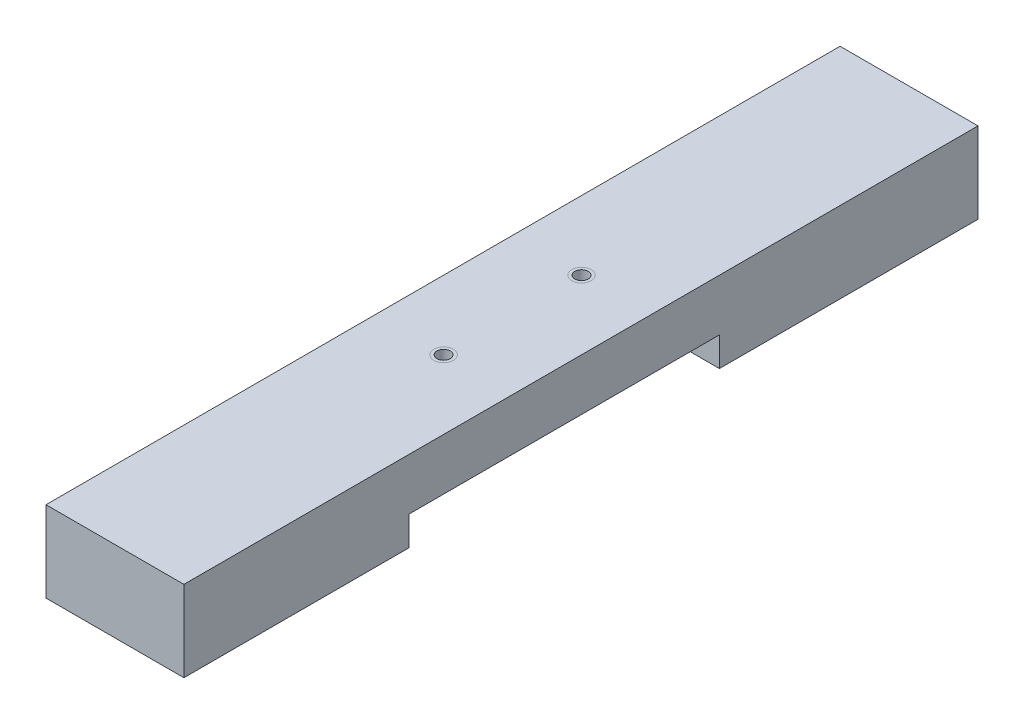
ISO-10303-21;
HEADER;
FILE_DESCRIPTION(('STEP AP214'),'2;1');
FILE_NAME('part.step','',(''),(''),'','','');
FILE_SCHEMA(('AUTOMOTIVE_DESIGN { 1 0 10303 214 1 1 1 1 }'));
ENDSEC;
DATA;
#1=APPLICATION_CONTEXT('core data for automotive mechanical design processes');
#2=APPLICATION_PROTOCOL_DEFINITION('international standard','automotive_design',2000,#1);
#3=PRODUCT_CONTEXT('',#1,'mechanical');
#4=PRODUCT('Part','Part','',(#3));
#5=PRODUCT_RELATED_PRODUCT_CATEGORY('part','',(#4));
#6=PRODUCT_DEFINITION_FORMATION('','',#4);
#7=PRODUCT_DEFINITION_CONTEXT('part definition',#1,'design');
#8=PRODUCT_DEFINITION('design','',#6,#7);
#9=PRODUCT_DEFINITION_SHAPE('','',#8);
#10=(LENGTH_UNIT() NAMED_UNIT(*) SI_UNIT(.MILLI.,.METRE.));
#11=(NAMED_UNIT(*) PLANE_ANGLE_UNIT() SI_UNIT($,.RADIAN.));
#12=(NAMED_UNIT(*) SI_UNIT($,.STERADIAN.) SOLID_ANGLE_UNIT());
#13=UNCERTAINTY_MEASURE_WITH_UNIT(LENGTH_MEASURE(1.E-05),#10,'distance_accuracy_value','');
#14=(GEOMETRIC_REPRESENTATION_CONTEXT(3) GLOBAL_UNCERTAINTY_ASSIGNED_CONTEXT((#13)) GLOBAL_UNIT_ASSIGNED_CONTEXT((#10,
#11,#12)) REPRESENTATION_CONTEXT('',''));
#15=CARTESIAN_POINT('',(0.,0.,0.));
#16=DIRECTION('',(0.,0.,1.));
#17=DIRECTION('',(1.,0.,0.));
#18=AXIS2_PLACEMENT_3D('',#15,#16,#17);
#19=CARTESIAN_POINT('',(0.,59.6,585.0001));
#20=DIRECTION('',(0.,-1.,0.));
#21=DIRECTION('',(0.,0.,-1.));
#22=AXIS2_PLACEMENT_3D('',#19,#20,#21);
#23=PLANE('',#22);
#24=CARTESIAN_POINT('',(50.8,59.6,241.3));
#25=DIRECTION('',(0.,-1.,0.));
#26=DIRECTION('',(0.,0.,-1.));
#27=AXIS2_PLACEMENT_3D('',#24,#25,#26);
#28=CIRCLE('',#27,7.14374999999999);
#29=CARTESIAN_POINT('',(50.8,59.6,234.15625));
#30=VERTEX_POINT('',#29);
#31=EDGE_CURVE('E56',#30,#30,#28,.F.);
#32=ORIENTED_EDGE('',*,*,#31,.F.);
#33=EDGE_LOOP('',(#32));
#34=FACE_BOUND('',#33,.T.);
#35=DIRECTION('',(-1.,0.,0.));
#36=VECTOR('',#35,1.);
#37=CARTESIAN_POINT('',(0.,59.6,0.));
#38=LINE('',#37,#36);
#39=CARTESIAN_POINT('',(101.6,59.6,0.));
#40=VERTEX_POINT('',#39);
#41=CARTESIAN_POINT('',(0.,59.6,0.));
#42=VERTEX_POINT('',#41);
#43=EDGE_CURVE('E93',#40,#42,#38,.T.);
#44=ORIENTED_EDGE('',*,*,#43,.T.);
#45=DIRECTION('',(0.,0.,-1.));
#46=VECTOR('',#45,1.);
#47=CARTESIAN_POINT('',(0.,59.6,585.0001));
#48=LINE('',#47,#46);
#49=CARTESIAN_POINT('',(0.,59.6,585.0001));
#50=VERTEX_POINT('',#49);
#51=EDGE_CURVE('E312',#50,#42,#48,.T.);
#52=ORIENTED_EDGE('',*,*,#51,.F.);
#53=DIRECTION('',(-1.,0.,0.));
#54=VECTOR('',#53,1.);
#55=CARTESIAN_POINT('',(0.,59.6,585.0001));
#56=LINE('',#55,#54);
#57=CARTESIAN_POINT('',(101.6,59.6,585.0001));
#58=VERTEX_POINT('',#57);
#59=EDGE_CURVE('E72',#58,#50,#56,.T.);
#60=ORIENTED_EDGE('',*,*,#59,.F.);
#61=DIRECTION('',(0.,0.,-1.));
#62=VECTOR('',#61,1.);
#63=CARTESIAN_POINT('',(101.6,59.6,585.0001));
#64=LINE('',#63,#62);
#65=EDGE_CURVE('E147',#58,#40,#64,.T.);
#66=ORIENTED_EDGE('',*,*,#65,.T.);
#67=EDGE_LOOP('',(#44,#52,#60,#66));
#68=FACE_BOUND('',#67,.T.);
#69=CARTESIAN_POINT('',(50.8,59.6,342.9));
#70=DIRECTION('',(0.,-1.,0.));
#71=DIRECTION('',(0.,0.,-1.));
#72=AXIS2_PLACEMENT_3D('',#69,#70,#71);
#73=CIRCLE('',#72,7.14375);
#74=CARTESIAN_POINT('',(50.8,59.6,335.75625));
#75=VERTEX_POINT('',#74);
#76=EDGE_CURVE('E12',#75,#75,#73,.F.);
#77=ORIENTED_EDGE('',*,*,#76,.F.);
#78=EDGE_LOOP('',(#77));
#79=FACE_BOUND('',#78,.T.);
#80=ADVANCED_FACE('F47',(#34,#68,#79),#23,.F.);
#81=ORIENTED_EDGE('',*,*,#76,.T.);
#82=EDGE_LOOP('',(#81));
#83=FACE_BOUND('',#82,.T.);
#84=CARTESIAN_POINT('',(50.8,59.6,342.9));
#85=DIRECTION('',(0.,-1.,0.));
#86=DIRECTION('',(0.,0.,-1.));
#87=AXIS2_PLACEMENT_3D('',#84,#85,#86);
#88=CIRCLE('',#87,4.93435191606347);
#89=CARTESIAN_POINT('',(50.8,59.6,337.965648083937));
#90=VERTEX_POINT('',#89);
#91=EDGE_CURVE('E161',#90,#90,#88,.T.);
#92=ORIENTED_EDGE('',*,*,#91,.T.);
#93=EDGE_LOOP('',(#92));
#94=FACE_BOUND('',#93,.T.);
#95=ADVANCED_FACE('F337',(#83,#94),#23,.F.);
#96=CARTESIAN_POINT('',(0.,0.,585.0001));
#97=DIRECTION('',(0.,1.,0.));
#98=DIRECTION('',(0.,0.,1.));
#99=AXIS2_PLACEMENT_3D('',#96,#97,#98);
#100=PLANE('',#99);
#101=DIRECTION('',(0.,0.,-1.));
#102=VECTOR('',#101,1.);
#103=CARTESIAN_POINT('',(101.6,0.,585.0001));
#104=LINE('',#103,#102);
#105=CARTESIAN_POINT('',(101.6,0.,190.5));
#106=VERTEX_POINT('',#105);
#107=CARTESIAN_POINT('',(101.6,0.,0.));
#108=VERTEX_POINT('',#107);
#109=EDGE_CURVE('E144',#106,#108,#104,.T.);
#110=ORIENTED_EDGE('',*,*,#109,.F.);
#111=DIRECTION('',(-1.,0.,0.));
#112=VECTOR('',#111,1.);
#113=CARTESIAN_POINT('',(101.6,0.,190.5));
#114=LINE('',#113,#112);
#115=CARTESIAN_POINT('',(0.,0.,190.5));
#116=VERTEX_POINT('',#115);
#117=EDGE_CURVE('E296',#106,#116,#114,.T.);
#118=ORIENTED_EDGE('',*,*,#117,.T.);
#119=DIRECTION('',(0.,0.,-1.));
#120=VECTOR('',#119,1.);
#121=CARTESIAN_POINT('',(0.,0.,585.0001));
#122=LINE('',#121,#120);
#123=CARTESIAN_POINT('',(0.,0.,0.));
#124=VERTEX_POINT('',#123);
#125=EDGE_CURVE('E143',#116,#124,#122,.T.);
#126=ORIENTED_EDGE('',*,*,#125,.T.);
#127=DIRECTION('',(1.,0.,0.));
#128=VECTOR('',#127,1.);
#129=CARTESIAN_POINT('',(0.,0.,0.));
#130=LINE('',#129,#128);
#131=EDGE_CURVE('E303',#124,#108,#130,.T.);
#132=ORIENTED_EDGE('',*,*,#131,.T.);
#133=EDGE_LOOP('',(#110,#118,#126,#132));
#134=FACE_BOUND('',#133,.T.);
#135=ADVANCED_FACE('F299',(#134),#100,.F.);
#136=CARTESIAN_POINT('',(0.,0.,585.0001));
#137=DIRECTION('',(1.,0.,0.));
#138=DIRECTION('',(0.,0.,-1.));
#139=AXIS2_PLACEMENT_3D('',#136,#137,#138);
#140=PLANE('',#139);
#141=CARTESIAN_POINT('',(0.,6.59999999999776,579.));
#142=DIRECTION('',(1.,0.,0.));
#143=DIRECTION('',(0.,0.,-1.));
#144=AXIS2_PLACEMENT_3D('',#141,#142,#143);
#145=CIRCLE('',#144,3.30000000000003);
#146=CARTESIAN_POINT('',(0.,6.59999999999776,575.7));
#147=VERTEX_POINT('',#146);
#148=EDGE_CURVE('E167',#147,#147,#145,.T.);
#149=ORIENTED_EDGE('',*,*,#148,.T.);
#150=EDGE_LOOP('',(#149));
#151=FACE_BOUND('',#150,.T.);
#152=CARTESIAN_POINT('',(0.,52.5999999999978,579.));
#153=DIRECTION('',(1.,0.,0.));
#154=DIRECTION('',(0.,0.,-1.));
#155=AXIS2_PLACEMENT_3D('',#152,#153,#154);
#156=CIRCLE('',#155,3.30000000000003);
#157=CARTESIAN_POINT('',(0.,52.5999999999978,575.7));
#158=VERTEX_POINT('',#157);
#159=EDGE_CURVE('E173',#158,#158,#156,.T.);
#160=ORIENTED_EDGE('',*,*,#159,.T.);
#161=EDGE_LOOP('',(#160));
#162=FACE_BOUND('',#161,.T.);
#163=CARTESIAN_POINT('',(0.,52.5999999999978,566.));
#164=DIRECTION('',(1.,0.,0.));
#165=DIRECTION('',(0.,0.,-1.));
#166=AXIS2_PLACEMENT_3D('',#163,#164,#165);
#167=CIRCLE('',#166,3.30000000000003);
#168=CARTESIAN_POINT('',(0.,52.5999999999978,562.7));
#169=VERTEX_POINT('',#168);
#170=EDGE_CURVE('E179',#169,#169,#167,.T.);
#171=ORIENTED_EDGE('',*,*,#170,.T.);
#172=EDGE_LOOP('',(#171));
#173=FACE_BOUND('',#172,.T.);
#174=CARTESIAN_POINT('',(0.,6.59999999999777,10.0000000000001));
#175=DIRECTION('',(1.,0.,0.));
#176=DIRECTION('',(0.,0.,-1.));
#177=AXIS2_PLACEMENT_3D('',#174,#175,#176);
#178=CIRCLE('',#177,3.3);
#179=CARTESIAN_POINT('',(0.,6.59999999999777,6.70000000000008));
#180=VERTEX_POINT('',#179);
#181=EDGE_CURVE('E185',#180,#180,#178,.T.);
#182=ORIENTED_EDGE('',*,*,#181,.T.);
#183=EDGE_LOOP('',(#182));
#184=FACE_BOUND('',#183,.T.);
#185=CARTESIAN_POINT('',(0.,52.5999999999978,10.0000000000001));
#186=DIRECTION('',(1.,0.,0.));
#187=DIRECTION('',(0.,0.,-1.));
#188=AXIS2_PLACEMENT_3D('',#185,#186,#187);
#189=CIRCLE('',#188,3.3);
#190=CARTESIAN_POINT('',(0.,52.5999999999978,6.70000000000008));
#191=VERTEX_POINT('',#190);
#192=EDGE_CURVE('E155',#191,#191,#189,.T.);
#193=ORIENTED_EDGE('',*,*,#192,.T.);
#194=EDGE_LOOP('',(#193));
#195=FACE_BOUND('',#194,.T.);
#196=CARTESIAN_POINT('',(0.,6.59999999999776,566.));
#197=DIRECTION('',(1.,0.,0.));
#198=DIRECTION('',(0.,0.,-1.));
#199=AXIS2_PLACEMENT_3D('',#196,#197,#198);
#200=CIRCLE('',#199,3.30000000000003);
#201=CARTESIAN_POINT('',(0.,6.59999999999776,562.7));
#202=VERTEX_POINT('',#201);
#203=EDGE_CURVE('E166',#202,#202,#200,.T.);
#204=ORIENTED_EDGE('',*,*,#203,.T.);
#205=EDGE_LOOP('',(#204));
#206=FACE_BOUND('',#205,.T.);
#207=CARTESIAN_POINT('',(0.,29.5999999999993,530.));
#208=DIRECTION('',(1.,0.,0.));
#209=DIRECTION('',(0.,0.,-1.));
#210=AXIS2_PLACEMENT_3D('',#207,#208,#209);
#211=CIRCLE('',#210,1.75);
#212=CARTESIAN_POINT('',(0.,29.5999999999993,528.25));
#213=VERTEX_POINT('',#212);
#214=EDGE_CURVE('E198',#213,#213,#211,.T.);
#215=ORIENTED_EDGE('',*,*,#214,.T.);
#216=EDGE_LOOP('',(#215));
#217=FACE_BOUND('',#216,.T.);
#218=CARTESIAN_POINT('',(0.,29.5999999999993,470.));
#219=DIRECTION('',(1.,0.,0.));
#220=DIRECTION('',(0.,0.,-1.));
#221=AXIS2_PLACEMENT_3D('',#218,#219,#220);
#222=CIRCLE('',#221,1.75);
#223=CARTESIAN_POINT('',(0.,29.5999999999993,468.25));
#224=VERTEX_POINT('',#223);
#225=EDGE_CURVE('E201',#224,#224,#222,.T.);
#226=ORIENTED_EDGE('',*,*,#225,.T.);
#227=EDGE_LOOP('',(#226));
#228=FACE_BOUND('',#227,.T.);
#229=CARTESIAN_POINT('',(0.,29.5999999999993,410.));
#230=DIRECTION('',(1.,0.,0.));
#231=DIRECTION('',(0.,0.,-1.));
#232=AXIS2_PLACEMENT_3D('',#229,#230,#231);
#233=CIRCLE('',#232,1.75);
#234=CARTESIAN_POINT('',(0.,29.5999999999993,408.25));
#235=VERTEX_POINT('',#234);
#236=EDGE_CURVE('E207',#235,#235,#233,.T.);
#237=ORIENTED_EDGE('',*,*,#236,.T.);
#238=EDGE_LOOP('',(#237));
#239=FACE_BOUND('',#238,.T.);
#240=CARTESIAN_POINT('',(0.,29.5999999999993,350.));
#241=DIRECTION('',(1.,0.,0.));
#242=DIRECTION('',(0.,0.,-1.));
#243=AXIS2_PLACEMENT_3D('',#240,#241,#242);
#244=CIRCLE('',#243,1.75);
#245=CARTESIAN_POINT('',(0.,29.5999999999993,348.25));
#246=VERTEX_POINT('',#245);
#247=EDGE_CURVE('E212',#246,#246,#244,.T.);
#248=ORIENTED_EDGE('',*,*,#247,.T.);
#249=EDGE_LOOP('',(#248));
#250=FACE_BOUND('',#249,.T.);
#251=CARTESIAN_POINT('',(0.,29.5999999999993,290.));
#252=DIRECTION('',(1.,0.,0.));
#253=DIRECTION('',(0.,0.,-1.));
#254=AXIS2_PLACEMENT_3D('',#251,#252,#253);
#255=CIRCLE('',#254,1.75);
#256=CARTESIAN_POINT('',(0.,29.5999999999993,288.25));
#257=VERTEX_POINT('',#256);
#258=EDGE_CURVE('E219',#257,#257,#255,.T.);
#259=ORIENTED_EDGE('',*,*,#258,.T.);
#260=EDGE_LOOP('',(#259));
#261=FACE_BOUND('',#260,.T.);
#262=CARTESIAN_POINT('',(0.,29.5999999999993,230.));
#263=DIRECTION('',(1.,0.,0.));
#264=DIRECTION('',(0.,0.,-1.));
#265=AXIS2_PLACEMENT_3D('',#262,#263,#264);
#266=CIRCLE('',#265,1.75);
#267=CARTESIAN_POINT('',(0.,29.5999999999993,228.25));
#268=VERTEX_POINT('',#267);
#269=EDGE_CURVE('E225',#268,#268,#266,.T.);
#270=ORIENTED_EDGE('',*,*,#269,.T.);
#271=EDGE_LOOP('',(#270));
#272=FACE_BOUND('',#271,.T.);
#273=CARTESIAN_POINT('',(0.,29.5999999999993,170.));
#274=DIRECTION('',(1.,0.,0.));
#275=DIRECTION('',(0.,0.,-1.));
#276=AXIS2_PLACEMENT_3D('',#273,#274,#275);
#277=CIRCLE('',#276,1.75);
#278=CARTESIAN_POINT('',(0.,29.5999999999993,168.25));
#279=VERTEX_POINT('',#278);
#280=EDGE_CURVE('E231',#279,#279,#277,.T.);
#281=ORIENTED_EDGE('',*,*,#280,.T.);
#282=EDGE_LOOP('',(#281));
#283=FACE_BOUND('',#282,.T.);
#284=CARTESIAN_POINT('',(0.,29.5999999999993,110.));
#285=DIRECTION('',(1.,0.,0.));
#286=DIRECTION('',(0.,0.,-1.));
#287=AXIS2_PLACEMENT_3D('',#284,#285,#286);
#288=CIRCLE('',#287,1.75);
#289=CARTESIAN_POINT('',(0.,29.5999999999993,108.25));
#290=VERTEX_POINT('',#289);
#291=EDGE_CURVE('E240',#290,#290,#288,.T.);
#292=ORIENTED_EDGE('',*,*,#291,.T.);
#293=EDGE_LOOP('',(#292));
#294=FACE_BOUND('',#293,.T.);
#295=CARTESIAN_POINT('',(0.,29.5999999999993,50.));
#296=DIRECTION('',(1.,0.,0.));
#297=DIRECTION('',(0.,0.,-1.));
#298=AXIS2_PLACEMENT_3D('',#295,#296,#297);
#299=CIRCLE('',#298,1.75);
#300=CARTESIAN_POINT('',(0.,29.5999999999993,48.25));
#301=VERTEX_POINT('',#300);
#302=EDGE_CURVE('E247',#301,#301,#299,.T.);
#303=ORIENTED_EDGE('',*,*,#302,.T.);
#304=EDGE_LOOP('',(#303));
#305=FACE_BOUND('',#304,.T.);
#306=ORIENTED_EDGE('',*,*,#125,.F.);
#307=DIRECTION('',(0.,-1.,0.));
#308=VECTOR('',#307,1.);
#309=CARTESIAN_POINT('',(0.,0.,190.5));
#310=LINE('',#309,#308);
#311=CARTESIAN_POINT('',(0.,21.5,190.5));
#312=VERTEX_POINT('',#311);
#313=EDGE_CURVE('E131',#312,#116,#310,.T.);
#314=ORIENTED_EDGE('',*,*,#313,.F.);
#315=DIRECTION('',(0.,0.,-1.));
#316=VECTOR('',#315,1.);
#317=CARTESIAN_POINT('',(0.,21.5,190.5));
#318=LINE('',#317,#316);
#319=CARTESIAN_POINT('',(0.,21.5,419.1));
#320=VERTEX_POINT('',#319);
#321=EDGE_CURVE('E256',#320,#312,#318,.T.);
#322=ORIENTED_EDGE('',*,*,#321,.F.);
#323=DIRECTION('',(0.,1.,0.));
#324=VECTOR('',#323,1.);
#325=CARTESIAN_POINT('',(0.,21.5,419.1));
#326=LINE('',#325,#324);
#327=CARTESIAN_POINT('',(0.,0.,419.1));
#328=VERTEX_POINT('',#327);
#329=EDGE_CURVE('E197',#328,#320,#326,.T.);
#330=ORIENTED_EDGE('',*,*,#329,.F.);
#331=CARTESIAN_POINT('',(0.,0.,585.0001));
#332=VERTEX_POINT('',#331);
#333=EDGE_CURVE('E137',#332,#328,#122,.T.);
#334=ORIENTED_EDGE('',*,*,#333,.F.);
#335=DIRECTION('',(0.,-1.,0.));
#336=VECTOR('',#335,1.);
#337=CARTESIAN_POINT('',(0.,0.,585.0001));
#338=LINE('',#337,#336);
#339=EDGE_CURVE('E308',#50,#332,#338,.T.);
#340=ORIENTED_EDGE('',*,*,#339,.F.);
#341=ORIENTED_EDGE('',*,*,#51,.T.);
#342=DIRECTION('',(0.,-1.,0.));
#343=VECTOR('',#342,1.);
#344=CARTESIAN_POINT('',(0.,0.,0.));
#345=LINE('',#344,#343);
#346=EDGE_CURVE('E302',#42,#124,#345,.T.);
#347=ORIENTED_EDGE('',*,*,#346,.T.);
#348=EDGE_LOOP('',(#306,#314,#322,#330,#334,#340,#341,#347));
#349=FACE_BOUND('',#348,.T.);
#350=ADVANCED_FACE('F49',(#151,#162,#173,#184,#195,#206,#217,#228,#239,#250,#261,#272,#283,#294,
#305,#349),#140,.F.);
#351=ORIENTED_EDGE('',*,*,#333,.T.);
#352=DIRECTION('',(-1.,0.,0.));
#353=VECTOR('',#352,1.);
#354=CARTESIAN_POINT('',(101.6,0.,419.1));
#355=LINE('',#354,#353);
#356=CARTESIAN_POINT('',(101.6,0.,419.1));
#357=VERTEX_POINT('',#356);
#358=EDGE_CURVE('E126',#357,#328,#355,.T.);
#359=ORIENTED_EDGE('',*,*,#358,.F.);
#360=CARTESIAN_POINT('',(101.6,0.,585.0001));
#361=VERTEX_POINT('',#360);
#362=EDGE_CURVE('E134',#361,#357,#104,.T.);
#363=ORIENTED_EDGE('',*,*,#362,.F.);
#364=DIRECTION('',(1.,0.,0.));
#365=VECTOR('',#364,1.);
#366=CARTESIAN_POINT('',(0.,0.,585.0001));
#367=LINE('',#366,#365);
#368=EDGE_CURVE('E101',#332,#361,#367,.T.);
#369=ORIENTED_EDGE('',*,*,#368,.F.);
#370=EDGE_LOOP('',(#351,#359,#363,#369));
#371=FACE_BOUND('',#370,.T.);
#372=ADVANCED_FACE('F133',(#371),#100,.F.);
#373=CARTESIAN_POINT('',(101.6,0.,585.0001));
#374=DIRECTION('',(-1.,0.,0.));
#375=DIRECTION('',(0.,0.,1.));
#376=AXIS2_PLACEMENT_3D('',#373,#374,#375);
#377=PLANE('',#376);
#378=DIRECTION('',(0.,0.,-1.));
#379=VECTOR('',#378,1.);
#380=CARTESIAN_POINT('',(101.6,21.5,190.5));
#381=LINE('',#380,#379);
#382=CARTESIAN_POINT('',(101.6,21.5,419.1));
#383=VERTEX_POINT('',#382);
#384=CARTESIAN_POINT('',(101.6,21.5,190.5));
#385=VERTEX_POINT('',#384);
#386=EDGE_CURVE('E63',#383,#385,#381,.T.);
#387=ORIENTED_EDGE('',*,*,#386,.T.);
#388=DIRECTION('',(0.,-1.,0.));
#389=VECTOR('',#388,1.);
#390=CARTESIAN_POINT('',(101.6,0.,190.5));
#391=LINE('',#390,#389);
#392=EDGE_CURVE('E138',#385,#106,#391,.T.);
#393=ORIENTED_EDGE('',*,*,#392,.T.);
#394=ORIENTED_EDGE('',*,*,#109,.T.);
#395=DIRECTION('',(0.,1.,0.));
#396=VECTOR('',#395,1.);
#397=CARTESIAN_POINT('',(101.6,0.,0.));
#398=LINE('',#397,#396);
#399=EDGE_CURVE('E315',#108,#40,#398,.T.);
#400=ORIENTED_EDGE('',*,*,#399,.T.);
#401=ORIENTED_EDGE('',*,*,#65,.F.);
#402=DIRECTION('',(0.,1.,0.));
#403=VECTOR('',#402,1.);
#404=CARTESIAN_POINT('',(101.6,0.,585.0001));
#405=LINE('',#404,#403);
#406=EDGE_CURVE('E142',#361,#58,#405,.T.);
#407=ORIENTED_EDGE('',*,*,#406,.F.);
#408=ORIENTED_EDGE('',*,*,#362,.T.);
#409=DIRECTION('',(0.,1.,0.));
#410=VECTOR('',#409,1.);
#411=CARTESIAN_POINT('',(101.6,21.5,419.1));
#412=LINE('',#411,#410);
#413=EDGE_CURVE('E122',#357,#383,#412,.T.);
#414=ORIENTED_EDGE('',*,*,#413,.T.);
#415=EDGE_LOOP('',(#387,#393,#394,#400,#401,#407,#408,#414));
#416=FACE_BOUND('',#415,.T.);
#417=ADVANCED_FACE('F140',(#416),#377,.F.);
#418=ORIENTED_EDGE('',*,*,#31,.T.);
#419=EDGE_LOOP('',(#418));
#420=FACE_BOUND('',#419,.T.);
#421=CARTESIAN_POINT('',(50.8,59.6,241.3));
#422=DIRECTION('',(0.,-1.,0.));
#423=DIRECTION('',(0.,0.,-1.));
#424=AXIS2_PLACEMENT_3D('',#421,#422,#423);
#425=CIRCLE('',#424,4.93435191606347);
#426=CARTESIAN_POINT('',(50.8,59.6,236.365648083937));
#427=VERTEX_POINT('',#426);
#428=EDGE_CURVE('E271',#427,#427,#425,.T.);
#429=ORIENTED_EDGE('',*,*,#428,.T.);
#430=EDGE_LOOP('',(#429));
#431=FACE_BOUND('',#430,.T.);
#432=ADVANCED_FACE('F333',(#420,#431),#23,.F.);
#433=CARTESIAN_POINT('',(0.,0.,585.0001));
#434=DIRECTION('',(0.,0.,-1.));
#435=DIRECTION('',(-1.,0.,0.));
#436=AXIS2_PLACEMENT_3D('',#433,#434,#435);
#437=PLANE('',#436);
#438=ORIENTED_EDGE('',*,*,#339,.T.);
#439=ORIENTED_EDGE('',*,*,#368,.T.);
#440=ORIENTED_EDGE('',*,*,#406,.T.);
#441=ORIENTED_EDGE('',*,*,#59,.T.);
#442=EDGE_LOOP('',(#438,#439,#440,#441));
#443=FACE_BOUND('',#442,.T.);
#444=ADVANCED_FACE('F326',(#443),#437,.F.);
#445=CARTESIAN_POINT('',(0.,0.,0.));
#446=DIRECTION('',(0.,0.,-1.));
#447=DIRECTION('',(-1.,0.,0.));
#448=AXIS2_PLACEMENT_3D('',#445,#446,#447);
#449=PLANE('',#448);
#450=ORIENTED_EDGE('',*,*,#346,.F.);
#451=ORIENTED_EDGE('',*,*,#43,.F.);
#452=ORIENTED_EDGE('',*,*,#399,.F.);
#453=ORIENTED_EDGE('',*,*,#131,.F.);
#454=EDGE_LOOP('',(#450,#451,#452,#453));
#455=FACE_BOUND('',#454,.T.);
#456=ADVANCED_FACE('F324',(#455),#449,.T.);
#457=CARTESIAN_POINT('',(101.6,0.,190.5));
#458=DIRECTION('',(0.,0.,-1.));
#459=DIRECTION('',(-1.,0.,0.));
#460=AXIS2_PLACEMENT_3D('',#457,#458,#459);
#461=PLANE('',#460);
#462=ORIENTED_EDGE('',*,*,#313,.T.);
#463=ORIENTED_EDGE('',*,*,#117,.F.);
#464=ORIENTED_EDGE('',*,*,#392,.F.);
#465=DIRECTION('',(-1.,0.,0.));
#466=VECTOR('',#465,1.);
#467=CARTESIAN_POINT('',(101.6,21.5,190.5));
#468=LINE('',#467,#466);
#469=EDGE_CURVE('E289',#385,#312,#468,.T.);
#470=ORIENTED_EDGE('',*,*,#469,.T.);
#471=EDGE_LOOP('',(#462,#463,#464,#470));
#472=FACE_BOUND('',#471,.T.);
#473=ADVANCED_FACE('F284',(#472),#461,.F.);
#474=CARTESIAN_POINT('',(101.6,21.5,190.5));
#475=DIRECTION('',(0.,1.,0.));
#476=DIRECTION('',(0.,0.,1.));
#477=AXIS2_PLACEMENT_3D('',#474,#475,#476);
#478=PLANE('',#477);
#479=CARTESIAN_POINT('',(50.8,21.5,342.9));
#480=DIRECTION('',(0.,-1.,0.));
#481=DIRECTION('',(0.,0.,-1.));
#482=AXIS2_PLACEMENT_3D('',#479,#480,#481);
#483=CIRCLE('',#482,4.93435191606347);
#484=CARTESIAN_POINT('',(50.8,21.5,337.965648083937));
#485=VERTEX_POINT('',#484);
#486=EDGE_CURVE('E267',#485,#485,#483,.T.);
#487=ORIENTED_EDGE('',*,*,#486,.F.);
#488=EDGE_LOOP('',(#487));
#489=FACE_BOUND('',#488,.T.);
#490=CARTESIAN_POINT('',(50.8,21.5,241.3));
#491=DIRECTION('',(0.,-1.,0.));
#492=DIRECTION('',(0.,0.,-1.));
#493=AXIS2_PLACEMENT_3D('',#490,#491,#492);
#494=CIRCLE('',#493,4.93435191606347);
#495=CARTESIAN_POINT('',(50.8,21.5,236.365648083937));
#496=VERTEX_POINT('',#495);
#497=EDGE_CURVE('E275',#496,#496,#494,.T.);
#498=ORIENTED_EDGE('',*,*,#497,.F.);
#499=EDGE_LOOP('',(#498));
#500=FACE_BOUND('',#499,.T.);
#501=ORIENTED_EDGE('',*,*,#321,.T.);
#502=ORIENTED_EDGE('',*,*,#469,.F.);
#503=ORIENTED_EDGE('',*,*,#386,.F.);
#504=DIRECTION('',(-1.,0.,0.));
#505=VECTOR('',#504,1.);
#506=CARTESIAN_POINT('',(101.6,21.5,419.1));
#507=LINE('',#506,#505);
#508=EDGE_CURVE('E128',#383,#320,#507,.T.);
#509=ORIENTED_EDGE('',*,*,#508,.T.);
#510=EDGE_LOOP('',(#501,#502,#503,#509));
#511=FACE_BOUND('',#510,.T.);
#512=ADVANCED_FACE('F282',(#489,#500,#511),#478,.F.);
#513=CARTESIAN_POINT('',(101.6,21.5,419.1));
#514=DIRECTION('',(0.,0.,1.));
#515=DIRECTION('',(1.,0.,0.));
#516=AXIS2_PLACEMENT_3D('',#513,#514,#515);
#517=PLANE('',#516);
#518=ORIENTED_EDGE('',*,*,#329,.T.);
#519=ORIENTED_EDGE('',*,*,#508,.F.);
#520=ORIENTED_EDGE('',*,*,#413,.F.);
#521=ORIENTED_EDGE('',*,*,#358,.T.);
#522=EDGE_LOOP('',(#518,#519,#520,#521));
#523=FACE_BOUND('',#522,.T.);
#524=ADVANCED_FACE('F125',(#523),#517,.F.);
#525=CARTESIAN_POINT('',(6.35,29.5999999999993,50.));
#526=DIRECTION('',(-1.,0.,0.));
#527=DIRECTION('',(0.,0.,1.));
#528=AXIS2_PLACEMENT_3D('',#525,#526,#527);
#529=CYLINDRICAL_SURFACE('',#528,1.75);
#530=ORIENTED_EDGE('',*,*,#302,.F.);
#531=EDGE_LOOP('',(#530));
#532=FACE_BOUND('',#531,.T.);
#533=CARTESIAN_POINT('',(6.35,29.5999999999993,50.));
#534=DIRECTION('',(1.,0.,0.));
#535=DIRECTION('',(0.,0.,-1.));
#536=AXIS2_PLACEMENT_3D('',#533,#534,#535);
#537=CIRCLE('',#536,1.75);
#538=CARTESIAN_POINT('',(6.35,29.5999999999993,48.25));
#539=VERTEX_POINT('',#538);
#540=EDGE_CURVE('E191',#539,#539,#537,.T.);
#541=ORIENTED_EDGE('',*,*,#540,.T.);
#542=EDGE_LOOP('',(#541));
#543=FACE_BOUND('',#542,.T.);
#544=ADVANCED_FACE('F476',(#532,#543),#529,.F.);
#545=CARTESIAN_POINT('',(6.35,29.5999999999993,50.));
#546=DIRECTION('',(1.,0.,0.));
#547=DIRECTION('',(0.,0.,-1.));
#548=AXIS2_PLACEMENT_3D('',#545,#546,#547);
#549=PLANE('',#548);
#550=ORIENTED_EDGE('',*,*,#540,.F.);
#551=EDGE_LOOP('',(#550));
#552=FACE_BOUND('',#551,.T.);
#553=ADVANCED_FACE('F471',(#552),#549,.F.);
#554=CARTESIAN_POINT('',(6.35,29.5999999999993,110.));
#555=DIRECTION('',(-1.,0.,0.));
#556=DIRECTION('',(0.,0.,1.));
#557=AXIS2_PLACEMENT_3D('',#554,#555,#556);
#558=CYLINDRICAL_SURFACE('',#557,1.75);
#559=ORIENTED_EDGE('',*,*,#291,.F.);
#560=EDGE_LOOP('',(#559));
#561=FACE_BOUND('',#560,.T.);
#562=CARTESIAN_POINT('',(6.35,29.5999999999993,110.));
#563=DIRECTION('',(1.,0.,0.));
#564=DIRECTION('',(0.,0.,-1.));
#565=AXIS2_PLACEMENT_3D('',#562,#563,#564);
#566=CIRCLE('',#565,1.75);
#567=CARTESIAN_POINT('',(6.35,29.5999999999993,108.25));
#568=VERTEX_POINT('',#567);
#569=EDGE_CURVE('E244',#568,#568,#566,.T.);
#570=ORIENTED_EDGE('',*,*,#569,.T.);
#571=EDGE_LOOP('',(#570));
#572=FACE_BOUND('',#571,.T.);
#573=ADVANCED_FACE('F468',(#561,#572),#558,.F.);
#574=CARTESIAN_POINT('',(6.35,29.5999999999993,110.));
#575=DIRECTION('',(1.,0.,0.));
#576=DIRECTION('',(0.,0.,-1.));
#577=AXIS2_PLACEMENT_3D('',#574,#575,#576);
#578=PLANE('',#577);
#579=ORIENTED_EDGE('',*,*,#569,.F.);
#580=EDGE_LOOP('',(#579));
#581=FACE_BOUND('',#580,.T.);
#582=ADVANCED_FACE('F463',(#581),#578,.F.);
#583=CARTESIAN_POINT('',(6.35,29.5999999999993,170.));
#584=DIRECTION('',(-1.,0.,0.));
#585=DIRECTION('',(0.,0.,1.));
#586=AXIS2_PLACEMENT_3D('',#583,#584,#585);
#587=CYLINDRICAL_SURFACE('',#586,1.75);
#588=ORIENTED_EDGE('',*,*,#280,.F.);
#589=EDGE_LOOP('',(#588));
#590=FACE_BOUND('',#589,.T.);
#591=CARTESIAN_POINT('',(6.35,29.5999999999993,170.));
#592=DIRECTION('',(1.,0.,0.));
#593=DIRECTION('',(0.,0.,-1.));
#594=AXIS2_PLACEMENT_3D('',#591,#592,#593);
#595=CIRCLE('',#594,1.75);
#596=CARTESIAN_POINT('',(6.35,29.5999999999993,168.25));
#597=VERTEX_POINT('',#596);
#598=EDGE_CURVE('E235',#597,#597,#595,.T.);
#599=ORIENTED_EDGE('',*,*,#598,.T.);
#600=EDGE_LOOP('',(#599));
#601=FACE_BOUND('',#600,.T.);
#602=ADVANCED_FACE('F460',(#590,#601),#587,.F.);
#603=CARTESIAN_POINT('',(6.35,29.5999999999993,170.));
#604=DIRECTION('',(1.,0.,0.));
#605=DIRECTION('',(0.,0.,-1.));
#606=AXIS2_PLACEMENT_3D('',#603,#604,#605);
#607=PLANE('',#606);
#608=ORIENTED_EDGE('',*,*,#598,.F.);
#609=EDGE_LOOP('',(#608));
#610=FACE_BOUND('',#609,.T.);
#611=ADVANCED_FACE('F455',(#610),#607,.F.);
#612=CARTESIAN_POINT('',(6.35,29.5999999999993,230.));
#613=DIRECTION('',(-1.,0.,0.));
#614=DIRECTION('',(0.,0.,1.));
#615=AXIS2_PLACEMENT_3D('',#612,#613,#614);
#616=CYLINDRICAL_SURFACE('',#615,1.75);
#617=ORIENTED_EDGE('',*,*,#269,.F.);
#618=EDGE_LOOP('',(#617));
#619=FACE_BOUND('',#618,.T.);
#620=CARTESIAN_POINT('',(6.35,29.5999999999993,230.));
#621=DIRECTION('',(1.,0.,0.));
#622=DIRECTION('',(0.,0.,-1.));
#623=AXIS2_PLACEMENT_3D('',#620,#621,#622);
#624=CIRCLE('',#623,1.75);
#625=CARTESIAN_POINT('',(6.35,29.5999999999993,228.25));
#626=VERTEX_POINT('',#625);
#627=EDGE_CURVE('E228',#626,#626,#624,.T.);
#628=ORIENTED_EDGE('',*,*,#627,.T.);
#629=EDGE_LOOP('',(#628));
#630=FACE_BOUND('',#629,.T.);
#631=ADVANCED_FACE('F452',(#619,#630),#616,.F.);
#632=CARTESIAN_POINT('',(6.35,29.5999999999993,230.));
#633=DIRECTION('',(1.,0.,0.));
#634=DIRECTION('',(0.,0.,-1.));
#635=AXIS2_PLACEMENT_3D('',#632,#633,#634);
#636=PLANE('',#635);
#637=ORIENTED_EDGE('',*,*,#627,.F.);
#638=EDGE_LOOP('',(#637));
#639=FACE_BOUND('',#638,.T.);
#640=ADVANCED_FACE('F447',(#639),#636,.F.);
#641=CARTESIAN_POINT('',(6.35,29.5999999999993,290.));
#642=DIRECTION('',(-1.,0.,0.));
#643=DIRECTION('',(0.,0.,1.));
#644=AXIS2_PLACEMENT_3D('',#641,#642,#643);
#645=CYLINDRICAL_SURFACE('',#644,1.75);
#646=ORIENTED_EDGE('',*,*,#258,.F.);
#647=EDGE_LOOP('',(#646));
#648=FACE_BOUND('',#647,.T.);
#649=CARTESIAN_POINT('',(6.35,29.5999999999993,290.));
#650=DIRECTION('',(1.,0.,0.));
#651=DIRECTION('',(0.,0.,-1.));
#652=AXIS2_PLACEMENT_3D('',#649,#650,#651);
#653=CIRCLE('',#652,1.75);
#654=CARTESIAN_POINT('',(6.35,29.5999999999993,288.25));
#655=VERTEX_POINT('',#654);
#656=EDGE_CURVE('E222',#655,#655,#653,.T.);
#657=ORIENTED_EDGE('',*,*,#656,.T.);
#658=EDGE_LOOP('',(#657));
#659=FACE_BOUND('',#658,.T.);
#660=ADVANCED_FACE('F444',(#648,#659),#645,.F.);
#661=CARTESIAN_POINT('',(6.35,29.5999999999993,290.));
#662=DIRECTION('',(1.,0.,0.));
#663=DIRECTION('',(0.,0.,-1.));
#664=AXIS2_PLACEMENT_3D('',#661,#662,#663);
#665=PLANE('',#664);
#666=ORIENTED_EDGE('',*,*,#656,.F.);
#667=EDGE_LOOP('',(#666));
#668=FACE_BOUND('',#667,.T.);
#669=ADVANCED_FACE('F439',(#668),#665,.F.);
#670=CARTESIAN_POINT('',(6.35,29.5999999999993,350.));
#671=DIRECTION('',(-1.,0.,0.));
#672=DIRECTION('',(0.,0.,1.));
#673=AXIS2_PLACEMENT_3D('',#670,#671,#672);
#674=CYLINDRICAL_SURFACE('',#673,1.75);
#675=ORIENTED_EDGE('',*,*,#247,.F.);
#676=EDGE_LOOP('',(#675));
#677=FACE_BOUND('',#676,.T.);
#678=CARTESIAN_POINT('',(6.35,29.5999999999993,350.));
#679=DIRECTION('',(1.,0.,0.));
#680=DIRECTION('',(0.,0.,-1.));
#681=AXIS2_PLACEMENT_3D('',#678,#679,#680);
#682=CIRCLE('',#681,1.75);
#683=CARTESIAN_POINT('',(6.35,29.5999999999993,348.25));
#684=VERTEX_POINT('',#683);
#685=EDGE_CURVE('E216',#684,#684,#682,.T.);
#686=ORIENTED_EDGE('',*,*,#685,.T.);
#687=EDGE_LOOP('',(#686));
#688=FACE_BOUND('',#687,.T.);
#689=ADVANCED_FACE('F436',(#677,#688),#674,.F.);
#690=CARTESIAN_POINT('',(6.35,29.5999999999993,350.));
#691=DIRECTION('',(1.,0.,0.));
#692=DIRECTION('',(0.,0.,-1.));
#693=AXIS2_PLACEMENT_3D('',#690,#691,#692);
#694=PLANE('',#693);
#695=ORIENTED_EDGE('',*,*,#685,.F.);
#696=EDGE_LOOP('',(#695));
#697=FACE_BOUND('',#696,.T.);
#698=ADVANCED_FACE('F431',(#697),#694,.F.);
#699=CARTESIAN_POINT('',(6.35,29.5999999999993,410.));
#700=DIRECTION('',(-1.,0.,0.));
#701=DIRECTION('',(0.,0.,1.));
#702=AXIS2_PLACEMENT_3D('',#699,#700,#701);
#703=CYLINDRICAL_SURFACE('',#702,1.75);
#704=ORIENTED_EDGE('',*,*,#236,.F.);
#705=EDGE_LOOP('',(#704));
#706=FACE_BOUND('',#705,.T.);
#707=CARTESIAN_POINT('',(6.35,29.5999999999993,410.));
#708=DIRECTION('',(1.,0.,0.));
#709=DIRECTION('',(0.,0.,-1.));
#710=AXIS2_PLACEMENT_3D('',#707,#708,#709);
#711=CIRCLE('',#710,1.75);
#712=CARTESIAN_POINT('',(6.35,29.5999999999993,408.25));
#713=VERTEX_POINT('',#712);
#714=EDGE_CURVE('E210',#713,#713,#711,.T.);
#715=ORIENTED_EDGE('',*,*,#714,.T.);
#716=EDGE_LOOP('',(#715));
#717=FACE_BOUND('',#716,.T.);
#718=ADVANCED_FACE('F428',(#706,#717),#703,.F.);
#719=CARTESIAN_POINT('',(6.35,29.5999999999993,410.));
#720=DIRECTION('',(1.,0.,0.));
#721=DIRECTION('',(0.,0.,-1.));
#722=AXIS2_PLACEMENT_3D('',#719,#720,#721);
#723=PLANE('',#722);
#724=ORIENTED_EDGE('',*,*,#714,.F.);
#725=EDGE_LOOP('',(#724));
#726=FACE_BOUND('',#725,.T.);
#727=ADVANCED_FACE('F423',(#726),#723,.F.);
#728=CARTESIAN_POINT('',(6.35,29.5999999999993,470.));
#729=DIRECTION('',(-1.,0.,0.));
#730=DIRECTION('',(0.,0.,1.));
#731=AXIS2_PLACEMENT_3D('',#728,#729,#730);
#732=CYLINDRICAL_SURFACE('',#731,1.75);
#733=ORIENTED_EDGE('',*,*,#225,.F.);
#734=EDGE_LOOP('',(#733));
#735=FACE_BOUND('',#734,.T.);
#736=CARTESIAN_POINT('',(6.35,29.5999999999993,470.));
#737=DIRECTION('',(1.,0.,0.));
#738=DIRECTION('',(0.,0.,-1.));
#739=AXIS2_PLACEMENT_3D('',#736,#737,#738);
#740=CIRCLE('',#739,1.75);
#741=CARTESIAN_POINT('',(6.35,29.5999999999993,468.25));
#742=VERTEX_POINT('',#741);
#743=EDGE_CURVE('E204',#742,#742,#740,.T.);
#744=ORIENTED_EDGE('',*,*,#743,.T.);
#745=EDGE_LOOP('',(#744));
#746=FACE_BOUND('',#745,.T.);
#747=ADVANCED_FACE('F420',(#735,#746),#732,.F.);
#748=CARTESIAN_POINT('',(6.35,29.5999999999993,470.));
#749=DIRECTION('',(1.,0.,0.));
#750=DIRECTION('',(0.,0.,-1.));
#751=AXIS2_PLACEMENT_3D('',#748,#749,#750);
#752=PLANE('',#751);
#753=ORIENTED_EDGE('',*,*,#743,.F.);
#754=EDGE_LOOP('',(#753));
#755=FACE_BOUND('',#754,.T.);
#756=ADVANCED_FACE('F418',(#755),#752,.F.);
#757=CARTESIAN_POINT('',(6.35,29.5999999999993,530.));
#758=DIRECTION('',(-1.,0.,0.));
#759=DIRECTION('',(0.,0.,1.));
#760=AXIS2_PLACEMENT_3D('',#757,#758,#759);
#761=CYLINDRICAL_SURFACE('',#760,1.75);
#762=ORIENTED_EDGE('',*,*,#214,.F.);
#763=EDGE_LOOP('',(#762));
#764=FACE_BOUND('',#763,.T.);
#765=CARTESIAN_POINT('',(6.35,29.5999999999993,530.));
#766=DIRECTION('',(1.,0.,0.));
#767=DIRECTION('',(0.,0.,-1.));
#768=AXIS2_PLACEMENT_3D('',#765,#766,#767);
#769=CIRCLE('',#768,1.75);
#770=CARTESIAN_POINT('',(6.35,29.5999999999993,528.25));
#771=VERTEX_POINT('',#770);
#772=EDGE_CURVE('E194',#771,#771,#769,.T.);
#773=ORIENTED_EDGE('',*,*,#772,.T.);
#774=EDGE_LOOP('',(#773));
#775=FACE_BOUND('',#774,.T.);
#776=ADVANCED_FACE('F414',(#764,#775),#761,.F.);
#777=CARTESIAN_POINT('',(6.35,29.5999999999993,530.));
#778=DIRECTION('',(1.,0.,0.));
#779=DIRECTION('',(0.,0.,-1.));
#780=AXIS2_PLACEMENT_3D('',#777,#778,#779);
#781=PLANE('',#780);
#782=ORIENTED_EDGE('',*,*,#772,.F.);
#783=EDGE_LOOP('',(#782));
#784=FACE_BOUND('',#783,.T.);
#785=ADVANCED_FACE('F410',(#784),#781,.F.);
#786=CARTESIAN_POINT('',(25.4,6.59999999999776,566.));
#787=DIRECTION('',(-1.,0.,0.));
#788=DIRECTION('',(0.,0.,1.));
#789=AXIS2_PLACEMENT_3D('',#786,#787,#788);
#790=CYLINDRICAL_SURFACE('',#789,3.30000000000003);
#791=CARTESIAN_POINT('',(25.4,6.59999999999776,566.));
#792=DIRECTION('',(1.,0.,0.));
#793=DIRECTION('',(0.,0.,-1.));
#794=AXIS2_PLACEMENT_3D('',#791,#792,#793);
#795=CIRCLE('',#794,3.30000000000003);
#796=CARTESIAN_POINT('',(25.4,6.59999999999776,562.7));
#797=VERTEX_POINT('',#796);
#798=EDGE_CURVE('E188',#797,#797,#795,.T.);
#799=ORIENTED_EDGE('',*,*,#798,.T.);
#800=EDGE_LOOP('',(#799));
#801=FACE_BOUND('',#800,.T.);
#802=ORIENTED_EDGE('',*,*,#203,.F.);
#803=EDGE_LOOP('',(#802));
#804=FACE_BOUND('',#803,.T.);
#805=ADVANCED_FACE('F406',(#801,#804),#790,.F.);
#806=CARTESIAN_POINT('',(25.4,6.59999999999776,566.));
#807=DIRECTION('',(1.,0.,0.));
#808=DIRECTION('',(0.,0.,-1.));
#809=AXIS2_PLACEMENT_3D('',#806,#807,#808);
#810=PLANE('',#809);
#811=ORIENTED_EDGE('',*,*,#798,.F.);
#812=EDGE_LOOP('',(#811));
#813=FACE_BOUND('',#812,.T.);
#814=ADVANCED_FACE('F375',(#813),#810,.F.);
#815=CARTESIAN_POINT('',(25.4,52.5999999999978,10.0000000000001));
#816=DIRECTION('',(-1.,0.,0.));
#817=DIRECTION('',(0.,0.,1.));
#818=AXIS2_PLACEMENT_3D('',#815,#816,#817);
#819=CYLINDRICAL_SURFACE('',#818,3.3);
#820=CARTESIAN_POINT('',(25.4,52.5999999999978,10.0000000000001));
#821=DIRECTION('',(1.,0.,0.));
#822=DIRECTION('',(0.,0.,-1.));
#823=AXIS2_PLACEMENT_3D('',#820,#821,#822);
#824=CIRCLE('',#823,3.3);
#825=CARTESIAN_POINT('',(25.4,52.5999999999978,6.70000000000008));
#826=VERTEX_POINT('',#825);
#827=EDGE_CURVE('E160',#826,#826,#824,.T.);
#828=ORIENTED_EDGE('',*,*,#827,.T.);
#829=EDGE_LOOP('',(#828));
#830=FACE_BOUND('',#829,.T.);
#831=ORIENTED_EDGE('',*,*,#192,.F.);
#832=EDGE_LOOP('',(#831));
#833=FACE_BOUND('',#832,.T.);
#834=ADVANCED_FACE('F372',(#830,#833),#819,.F.);
#835=CARTESIAN_POINT('',(25.4,52.5999999999978,10.0000000000001));
#836=DIRECTION('',(1.,0.,0.));
#837=DIRECTION('',(0.,0.,-1.));
#838=AXIS2_PLACEMENT_3D('',#835,#836,#837);
#839=PLANE('',#838);
#840=ORIENTED_EDGE('',*,*,#827,.F.);
#841=EDGE_LOOP('',(#840));
#842=FACE_BOUND('',#841,.T.);
#843=ADVANCED_FACE('F368',(#842),#839,.F.);
#844=CARTESIAN_POINT('',(25.4,6.59999999999777,10.0000000000001));
#845=DIRECTION('',(-1.,0.,0.));
#846=DIRECTION('',(0.,0.,1.));
#847=AXIS2_PLACEMENT_3D('',#844,#845,#846);
#848=CYLINDRICAL_SURFACE('',#847,3.3);
#849=CARTESIAN_POINT('',(25.4,6.59999999999777,10.0000000000001));
#850=DIRECTION('',(1.,0.,0.));
#851=DIRECTION('',(0.,0.,-1.));
#852=AXIS2_PLACEMENT_3D('',#849,#850,#851);
#853=CIRCLE('',#852,3.3);
#854=CARTESIAN_POINT('',(25.4,6.59999999999777,6.70000000000008));
#855=VERTEX_POINT('',#854);
#856=EDGE_CURVE('E182',#855,#855,#853,.T.);
#857=ORIENTED_EDGE('',*,*,#856,.T.);
#858=EDGE_LOOP('',(#857));
#859=FACE_BOUND('',#858,.T.);
#860=ORIENTED_EDGE('',*,*,#181,.F.);
#861=EDGE_LOOP('',(#860));
#862=FACE_BOUND('',#861,.T.);
#863=ADVANCED_FACE('F371',(#859,#862),#848,.F.);
#864=CARTESIAN_POINT('',(25.4,6.59999999999777,10.0000000000001));
#865=DIRECTION('',(1.,0.,0.));
#866=DIRECTION('',(0.,0.,-1.));
#867=AXIS2_PLACEMENT_3D('',#864,#865,#866);
#868=PLANE('',#867);
#869=ORIENTED_EDGE('',*,*,#856,.F.);
#870=EDGE_LOOP('',(#869));
#871=FACE_BOUND('',#870,.T.);
#872=ADVANCED_FACE('F396',(#871),#868,.F.);
#873=CARTESIAN_POINT('',(25.4,52.5999999999978,566.));
#874=DIRECTION('',(-1.,0.,0.));
#875=DIRECTION('',(0.,0.,1.));
#876=AXIS2_PLACEMENT_3D('',#873,#874,#875);
#877=CYLINDRICAL_SURFACE('',#876,3.30000000000003);
#878=CARTESIAN_POINT('',(25.4,52.5999999999978,566.));
#879=DIRECTION('',(1.,0.,0.));
#880=DIRECTION('',(0.,0.,-1.));
#881=AXIS2_PLACEMENT_3D('',#878,#879,#880);
#882=CIRCLE('',#881,3.30000000000003);
#883=CARTESIAN_POINT('',(25.4,52.5999999999978,562.7));
#884=VERTEX_POINT('',#883);
#885=EDGE_CURVE('E176',#884,#884,#882,.T.);
#886=ORIENTED_EDGE('',*,*,#885,.T.);
#887=EDGE_LOOP('',(#886));
#888=FACE_BOUND('',#887,.T.);
#889=ORIENTED_EDGE('',*,*,#170,.F.);
#890=EDGE_LOOP('',(#889));
#891=FACE_BOUND('',#890,.T.);
#892=ADVANCED_FACE('F392',(#888,#891),#877,.F.);
#893=CARTESIAN_POINT('',(25.4,52.5999999999978,566.));
#894=DIRECTION('',(1.,0.,0.));
#895=DIRECTION('',(0.,0.,-1.));
#896=AXIS2_PLACEMENT_3D('',#893,#894,#895);
#897=PLANE('',#896);
#898=ORIENTED_EDGE('',*,*,#885,.F.);
#899=EDGE_LOOP('',(#898));
#900=FACE_BOUND('',#899,.T.);
#901=ADVANCED_FACE('F388',(#900),#897,.F.);
#902=CARTESIAN_POINT('',(25.4,52.5999999999978,579.));
#903=DIRECTION('',(-1.,0.,0.));
#904=DIRECTION('',(0.,0.,1.));
#905=AXIS2_PLACEMENT_3D('',#902,#903,#904);
#906=CYLINDRICAL_SURFACE('',#905,3.30000000000003);
#907=CARTESIAN_POINT('',(25.4,52.5999999999978,579.));
#908=DIRECTION('',(1.,0.,0.));
#909=DIRECTION('',(0.,0.,-1.));
#910=AXIS2_PLACEMENT_3D('',#907,#908,#909);
#911=CIRCLE('',#910,3.30000000000003);
#912=CARTESIAN_POINT('',(25.4,52.5999999999978,575.7));
#913=VERTEX_POINT('',#912);
#914=EDGE_CURVE('E170',#913,#913,#911,.T.);
#915=ORIENTED_EDGE('',*,*,#914,.T.);
#916=EDGE_LOOP('',(#915));
#917=FACE_BOUND('',#916,.T.);
#918=ORIENTED_EDGE('',*,*,#159,.F.);
#919=EDGE_LOOP('',(#918));
#920=FACE_BOUND('',#919,.T.);
#921=ADVANCED_FACE('F384',(#917,#920),#906,.F.);
#922=CARTESIAN_POINT('',(25.4,52.5999999999978,579.));
#923=DIRECTION('',(1.,0.,0.));
#924=DIRECTION('',(0.,0.,-1.));
#925=AXIS2_PLACEMENT_3D('',#922,#923,#924);
#926=PLANE('',#925);
#927=ORIENTED_EDGE('',*,*,#914,.F.);
#928=EDGE_LOOP('',(#927));
#929=FACE_BOUND('',#928,.T.);
#930=ADVANCED_FACE('F380',(#929),#926,.F.);
#931=CARTESIAN_POINT('',(25.4,6.59999999999776,579.));
#932=DIRECTION('',(-1.,0.,0.));
#933=DIRECTION('',(0.,0.,1.));
#934=AXIS2_PLACEMENT_3D('',#931,#932,#933);
#935=CYLINDRICAL_SURFACE('',#934,3.30000000000003);
#936=CARTESIAN_POINT('',(25.4,6.59999999999776,579.));
#937=DIRECTION('',(1.,0.,0.));
#938=DIRECTION('',(0.,0.,-1.));
#939=AXIS2_PLACEMENT_3D('',#936,#937,#938);
#940=CIRCLE('',#939,3.30000000000003);
#941=CARTESIAN_POINT('',(25.4,6.59999999999776,575.7));
#942=VERTEX_POINT('',#941);
#943=EDGE_CURVE('E163',#942,#942,#940,.T.);
#944=ORIENTED_EDGE('',*,*,#943,.T.);
#945=EDGE_LOOP('',(#944));
#946=FACE_BOUND('',#945,.T.);
#947=ORIENTED_EDGE('',*,*,#148,.F.);
#948=EDGE_LOOP('',(#947));
#949=FACE_BOUND('',#948,.T.);
#950=ADVANCED_FACE('F364',(#946,#949),#935,.F.);
#951=CARTESIAN_POINT('',(25.4,6.59999999999776,579.));
#952=DIRECTION('',(1.,0.,0.));
#953=DIRECTION('',(0.,0.,-1.));
#954=AXIS2_PLACEMENT_3D('',#951,#952,#953);
#955=PLANE('',#954);
#956=ORIENTED_EDGE('',*,*,#943,.F.);
#957=EDGE_LOOP('',(#956));
#958=FACE_BOUND('',#957,.T.);
#959=ADVANCED_FACE('F356',(#958),#955,.F.);
#960=CARTESIAN_POINT('',(50.8,59.6,241.3));
#961=DIRECTION('',(0.,-1.,0.));
#962=DIRECTION('',(0.,0.,-1.));
#963=AXIS2_PLACEMENT_3D('',#960,#961,#962);
#964=CYLINDRICAL_SURFACE('',#963,4.93435191606347);
#965=ORIENTED_EDGE('',*,*,#428,.F.);
#966=EDGE_LOOP('',(#965));
#967=FACE_BOUND('',#966,.T.);
#968=ORIENTED_EDGE('',*,*,#497,.T.);
#969=EDGE_LOOP('',(#968));
#970=FACE_BOUND('',#969,.T.);
#971=ADVANCED_FACE('F280',(#967,#970),#964,.F.);
#972=CARTESIAN_POINT('',(50.8,59.6,342.9));
#973=DIRECTION('',(0.,-1.,0.));
#974=DIRECTION('',(0.,0.,-1.));
#975=AXIS2_PLACEMENT_3D('',#972,#973,#974);
#976=CYLINDRICAL_SURFACE('',#975,4.93435191606347);
#977=ORIENTED_EDGE('',*,*,#91,.F.);
#978=EDGE_LOOP('',(#977));
#979=FACE_BOUND('',#978,.T.);
#980=ORIENTED_EDGE('',*,*,#486,.T.);
#981=EDGE_LOOP('',(#980));
#982=FACE_BOUND('',#981,.T.);
#983=ADVANCED_FACE('F355',(#979,#982),#976,.F.);
#984=CLOSED_SHELL('',(#80,#95,#135,#350,#372,#417,#432,#444,#456,#473,#512,#524,#544,#553,#573,
#582,#602,#611,#631,#640,#660,#669,#689,#698,#718,#727,#747,#756,#776,#785,#805,#814,#834,#843,
#863,#872,#892,#901,#921,#930,#950,#959,#971,#983));
#985=MANIFOLD_SOLID_BREP('B2',#984);
#986=ADVANCED_BREP_SHAPE_REPRESENTATION('',(#18,#985),#14);
#987=SHAPE_DEFINITION_REPRESENTATION(#9,#986);
ENDSEC;
END-ISO-10303-21;
